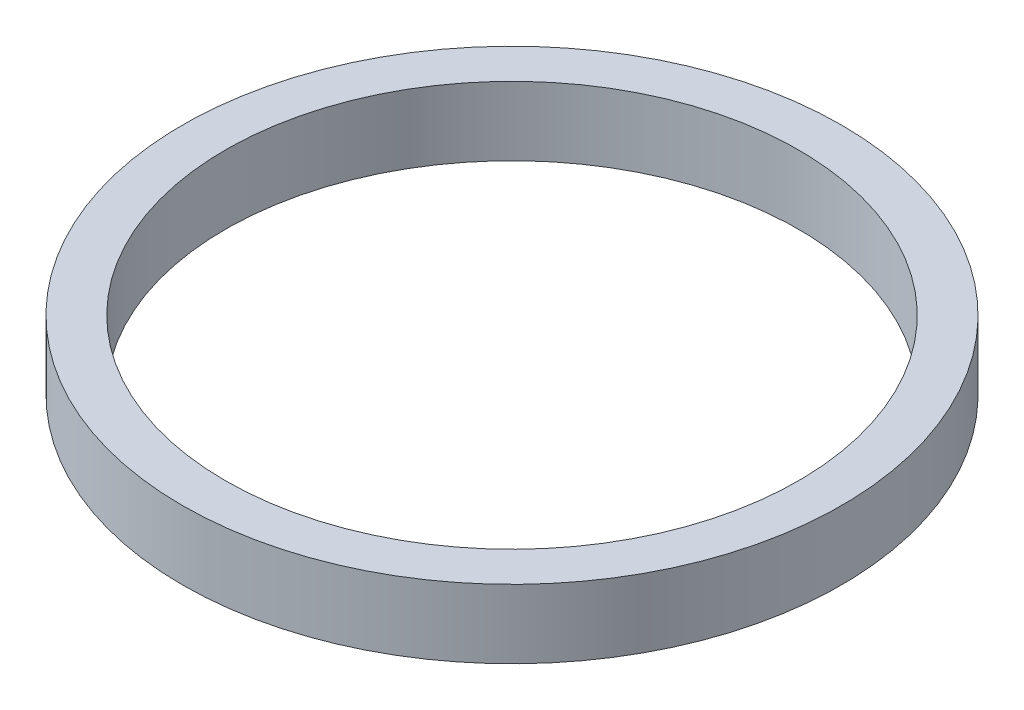
ISO-10303-21;
HEADER;
FILE_DESCRIPTION(('STEP AP214'),'2;1');
FILE_NAME('part.step','',(''),(''),'','','');
FILE_SCHEMA(('AUTOMOTIVE_DESIGN { 1 0 10303 214 1 1 1 1 }'));
ENDSEC;
DATA;
#1=APPLICATION_CONTEXT('core data for automotive mechanical design processes');
#2=APPLICATION_PROTOCOL_DEFINITION('international standard','automotive_design',2000,#1);
#3=PRODUCT_CONTEXT('',#1,'mechanical');
#4=PRODUCT('Part','Part','',(#3));
#5=PRODUCT_RELATED_PRODUCT_CATEGORY('part','',(#4));
#6=PRODUCT_DEFINITION_FORMATION('','',#4);
#7=PRODUCT_DEFINITION_CONTEXT('part definition',#1,'design');
#8=PRODUCT_DEFINITION('design','',#6,#7);
#9=PRODUCT_DEFINITION_SHAPE('','',#8);
#10=(LENGTH_UNIT() NAMED_UNIT(*) SI_UNIT(.MILLI.,.METRE.));
#11=(NAMED_UNIT(*) PLANE_ANGLE_UNIT() SI_UNIT($,.RADIAN.));
#12=(NAMED_UNIT(*) SI_UNIT($,.STERADIAN.) SOLID_ANGLE_UNIT());
#13=UNCERTAINTY_MEASURE_WITH_UNIT(LENGTH_MEASURE(1.E-05),#10,'distance_accuracy_value','');
#14=(GEOMETRIC_REPRESENTATION_CONTEXT(3) GLOBAL_UNCERTAINTY_ASSIGNED_CONTEXT((#13)) GLOBAL_UNIT_ASSIGNED_CONTEXT((#10,
#11,#12)) REPRESENTATION_CONTEXT('',''));
#15=CARTESIAN_POINT('',(0.,0.,0.));
#16=DIRECTION('',(0.,0.,1.));
#17=DIRECTION('',(1.,0.,0.));
#18=AXIS2_PLACEMENT_3D('',#15,#16,#17);
#19=CARTESIAN_POINT('',(0.,12.,0.));
#20=DIRECTION('',(0.,-1.,0.));
#21=DIRECTION('',(0.,0.,-1.));
#22=AXIS2_PLACEMENT_3D('',#19,#20,#21);
#23=CYLINDRICAL_SURFACE('',#22,57.5);
#24=CARTESIAN_POINT('',(0.,12.,0.));
#25=DIRECTION('',(0.,1.,0.));
#26=DIRECTION('',(0.,0.,1.));
#27=AXIS2_PLACEMENT_3D('',#24,#25,#26);
#28=CIRCLE('',#27,57.5);
#29=CARTESIAN_POINT('',(0.,12.,57.5));
#30=VERTEX_POINT('',#29);
#31=EDGE_CURVE('E10',#30,#30,#28,.T.);
#32=ORIENTED_EDGE('',*,*,#31,.F.);
#33=EDGE_LOOP('',(#32));
#34=FACE_BOUND('',#33,.T.);
#35=CARTESIAN_POINT('',(0.,0.,0.));
#36=DIRECTION('',(0.,1.,0.));
#37=DIRECTION('',(0.,0.,1.));
#38=AXIS2_PLACEMENT_3D('',#35,#36,#37);
#39=CIRCLE('',#38,57.5);
#40=CARTESIAN_POINT('',(0.,0.,57.5));
#41=VERTEX_POINT('',#40);
#42=EDGE_CURVE('E37',#41,#41,#39,.T.);
#43=ORIENTED_EDGE('',*,*,#42,.T.);
#44=EDGE_LOOP('',(#43));
#45=FACE_BOUND('',#44,.T.);
#46=ADVANCED_FACE('F40',(#34,#45),#23,.T.);
#47=CARTESIAN_POINT('',(0.,12.,0.));
#48=DIRECTION('',(0.,1.,0.));
#49=DIRECTION('',(0.,0.,1.));
#50=AXIS2_PLACEMENT_3D('',#47,#48,#49);
#51=PLANE('',#50);
#52=CARTESIAN_POINT('',(0.,12.,0.));
#53=DIRECTION('',(0.,1.,0.));
#54=DIRECTION('',(0.,0.,1.));
#55=AXIS2_PLACEMENT_3D('',#52,#53,#54);
#56=CIRCLE('',#55,50.);
#57=CARTESIAN_POINT('',(0.,12.,50.));
#58=VERTEX_POINT('',#57);
#59=EDGE_CURVE('E50',#58,#58,#56,.T.);
#60=ORIENTED_EDGE('',*,*,#59,.F.);
#61=EDGE_LOOP('',(#60));
#62=FACE_BOUND('',#61,.T.);
#63=ORIENTED_EDGE('',*,*,#31,.T.);
#64=EDGE_LOOP('',(#63));
#65=FACE_BOUND('',#64,.T.);
#66=ADVANCED_FACE('F59',(#62,#65),#51,.T.);
#67=CARTESIAN_POINT('',(0.,0.,0.));
#68=DIRECTION('',(0.,1.,0.));
#69=DIRECTION('',(0.,0.,1.));
#70=AXIS2_PLACEMENT_3D('',#67,#68,#69);
#71=PLANE('',#70);
#72=CARTESIAN_POINT('',(0.,0.,0.));
#73=DIRECTION('',(0.,1.,0.));
#74=DIRECTION('',(0.,0.,1.));
#75=AXIS2_PLACEMENT_3D('',#72,#73,#74);
#76=CIRCLE('',#75,50.);
#77=CARTESIAN_POINT('',(0.,0.,50.));
#78=VERTEX_POINT('',#77);
#79=EDGE_CURVE('E47',#78,#78,#76,.T.);
#80=ORIENTED_EDGE('',*,*,#79,.T.);
#81=EDGE_LOOP('',(#80));
#82=FACE_BOUND('',#81,.T.);
#83=ORIENTED_EDGE('',*,*,#42,.F.);
#84=EDGE_LOOP('',(#83));
#85=FACE_BOUND('',#84,.T.);
#86=ADVANCED_FACE('F58',(#82,#85),#71,.F.);
#87=CARTESIAN_POINT('',(0.,12.,0.));
#88=DIRECTION('',(0.,-1.,0.));
#89=DIRECTION('',(0.,0.,-1.));
#90=AXIS2_PLACEMENT_3D('',#87,#88,#89);
#91=CYLINDRICAL_SURFACE('',#90,50.);
#92=ORIENTED_EDGE('',*,*,#59,.T.);
#93=EDGE_LOOP('',(#92));
#94=FACE_BOUND('',#93,.T.);
#95=ORIENTED_EDGE('',*,*,#79,.F.);
#96=EDGE_LOOP('',(#95));
#97=FACE_BOUND('',#96,.T.);
#98=ADVANCED_FACE('F54',(#94,#97),#91,.F.);
#99=CLOSED_SHELL('',(#46,#66,#86,#98));
#100=MANIFOLD_SOLID_BREP('B2',#99);
#101=ADVANCED_BREP_SHAPE_REPRESENTATION('',(#18,#100),#14);
#102=SHAPE_DEFINITION_REPRESENTATION(#9,#101);
ENDSEC;
END-ISO-10303-21;
